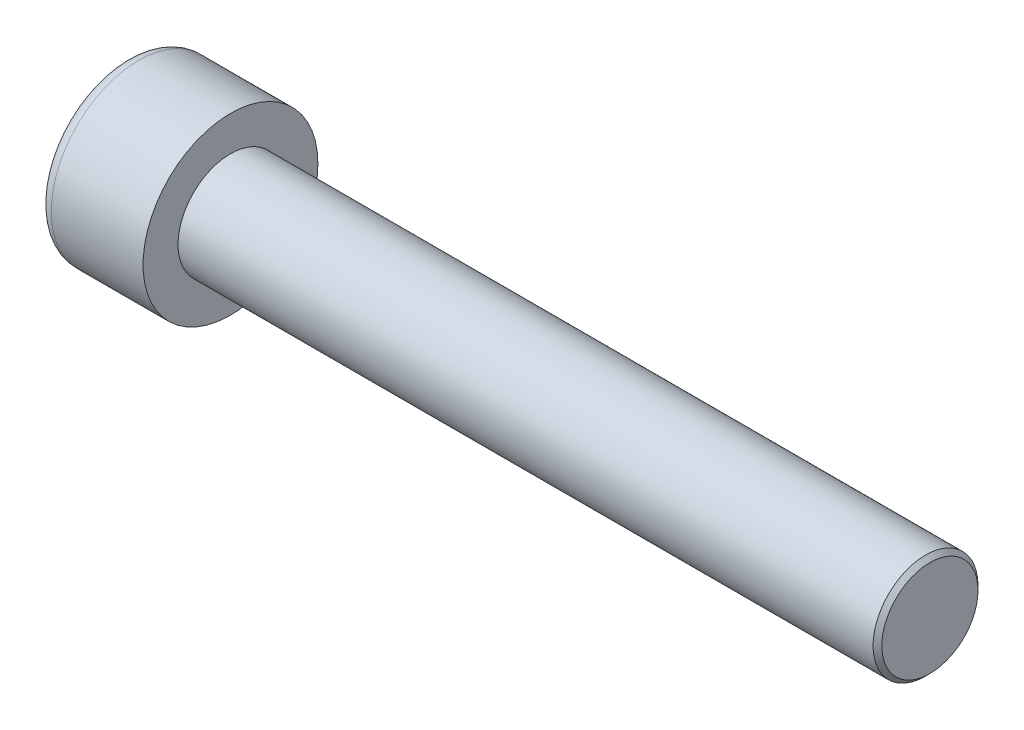
ISO-10303-21;
HEADER;
FILE_DESCRIPTION(('STEP AP214'),'2;1');
FILE_NAME('part.step','',(''),(''),'','','');
FILE_SCHEMA(('AUTOMOTIVE_DESIGN { 1 0 10303 214 1 1 1 1 }'));
ENDSEC;
DATA;
#1=APPLICATION_CONTEXT('core data for automotive mechanical design processes');
#2=APPLICATION_PROTOCOL_DEFINITION('international standard','automotive_design',2000,#1);
#3=PRODUCT_CONTEXT('',#1,'mechanical');
#4=PRODUCT('Part','Part','',(#3));
#5=PRODUCT_RELATED_PRODUCT_CATEGORY('part','',(#4));
#6=PRODUCT_DEFINITION_FORMATION('','',#4);
#7=PRODUCT_DEFINITION_CONTEXT('part definition',#1,'design');
#8=PRODUCT_DEFINITION('design','',#6,#7);
#9=PRODUCT_DEFINITION_SHAPE('','',#8);
#10=(LENGTH_UNIT() NAMED_UNIT(*) SI_UNIT(.MILLI.,.METRE.));
#11=(NAMED_UNIT(*) PLANE_ANGLE_UNIT() SI_UNIT($,.RADIAN.));
#12=(NAMED_UNIT(*) SI_UNIT($,.STERADIAN.) SOLID_ANGLE_UNIT());
#13=UNCERTAINTY_MEASURE_WITH_UNIT(LENGTH_MEASURE(1.E-05),#10,'distance_accuracy_value','');
#14=(GEOMETRIC_REPRESENTATION_CONTEXT(3) GLOBAL_UNCERTAINTY_ASSIGNED_CONTEXT((#13)) GLOBAL_UNIT_ASSIGNED_CONTEXT((#10,
#11,#12)) REPRESENTATION_CONTEXT('',''));
#15=CARTESIAN_POINT('',(0.,0.,0.));
#16=DIRECTION('',(0.,0.,1.));
#17=DIRECTION('',(1.,0.,0.));
#18=AXIS2_PLACEMENT_3D('',#15,#16,#17);
#19=CARTESIAN_POINT('',(3.,-5.00000000000023,0.));
#20=DIRECTION('',(-1.00000000000001,0.,0.));
#21=DIRECTION('',(0.,0.,0.999999999999996));
#22=AXIS2_PLACEMENT_3D('',#19,#20,#21);
#23=PLANE('',#22);
#24=DIRECTION('',(0.,-0.866025403784444,-0.499999999999999));
#25=VECTOR('',#24,1.);
#26=CARTESIAN_POINT('',(3.,-1.11022302462516E-13,2.88675134594785));
#27=LINE('',#26,#25);
#28=CARTESIAN_POINT('',(3.,-1.25000000000011,2.16506350946111));
#29=VERTEX_POINT('',#28);
#30=CARTESIAN_POINT('',(3.,-2.50000000000012,1.44337567297398));
#31=VERTEX_POINT('',#30);
#32=EDGE_CURVE('E161',#29,#31,#27,.T.);
#33=ORIENTED_EDGE('',*,*,#32,.F.);
#34=CARTESIAN_POINT('',(3.,0.,0.));
#35=DIRECTION('',(-1.00000000000001,0.,0.));
#36=DIRECTION('',(0.,0.,0.999999999999996));
#37=AXIS2_PLACEMENT_3D('',#34,#35,#36);
#38=CIRCLE('',#37,2.5);
#39=CARTESIAN_POINT('',(3.,-2.50000000000031,-1.59594559789866E-13));
#40=VERTEX_POINT('',#39);
#41=EDGE_CURVE('E56',#29,#40,#38,.F.);
#42=ORIENTED_EDGE('',*,*,#41,.T.);
#43=DIRECTION('',(0.,0.,-0.999999999999996));
#44=VECTOR('',#43,1.);
#45=CARTESIAN_POINT('',(3.,-2.50000000000012,1.44337567297398));
#46=LINE('',#45,#44);
#47=EDGE_CURVE('E166',#31,#40,#46,.T.);
#48=ORIENTED_EDGE('',*,*,#47,.F.);
#49=EDGE_LOOP('',(#33,#42,#48));
#50=FACE_BOUND('',#49,.T.);
#51=ADVANCED_FACE('F41',(#50),#23,.T.);
#52=CARTESIAN_POINT('',(3.,-2.50000000000001,-1.44337567297437));
#53=VERTEX_POINT('',#52);
#54=EDGE_CURVE('E165',#40,#53,#46,.T.);
#55=ORIENTED_EDGE('',*,*,#54,.F.);
#56=CARTESIAN_POINT('',(3.,-1.25000000000003,-2.16506350946105));
#57=VERTEX_POINT('',#56);
#58=EDGE_CURVE('E141',#40,#57,#38,.F.);
#59=ORIENTED_EDGE('',*,*,#58,.T.);
#60=DIRECTION('',(0.,0.866025403784444,-0.499999999999997));
#61=VECTOR('',#60,1.);
#62=CARTESIAN_POINT('',(3.,-2.50000000000001,-1.44337567297437));
#63=LINE('',#62,#61);
#64=EDGE_CURVE('E149',#53,#57,#63,.T.);
#65=ORIENTED_EDGE('',*,*,#64,.F.);
#66=EDGE_LOOP('',(#55,#59,#65));
#67=FACE_BOUND('',#66,.T.);
#68=ADVANCED_FACE('F222',(#67),#23,.T.);
#69=CARTESIAN_POINT('',(3.,0.,-2.88675134594835));
#70=VERTEX_POINT('',#69);
#71=EDGE_CURVE('E139',#57,#70,#63,.T.);
#72=ORIENTED_EDGE('',*,*,#71,.F.);
#73=CARTESIAN_POINT('',(3.,1.24999999999989,-2.16506350946133));
#74=VERTEX_POINT('',#73);
#75=EDGE_CURVE('E123',#57,#74,#38,.F.);
#76=ORIENTED_EDGE('',*,*,#75,.T.);
#77=DIRECTION('',(0.,0.866025403784444,0.499999999999999));
#78=VECTOR('',#77,1.);
#79=CARTESIAN_POINT('',(3.,0.,-2.88675134594835));
#80=LINE('',#79,#78);
#81=EDGE_CURVE('E137',#70,#74,#80,.T.);
#82=ORIENTED_EDGE('',*,*,#81,.F.);
#83=EDGE_LOOP('',(#72,#76,#82));
#84=FACE_BOUND('',#83,.T.);
#85=ADVANCED_FACE('F135',(#84),#23,.T.);
#86=CARTESIAN_POINT('',(3.,2.50000000000003,-1.44337567297426));
#87=VERTEX_POINT('',#86);
#88=EDGE_CURVE('E143',#74,#87,#80,.T.);
#89=ORIENTED_EDGE('',*,*,#88,.F.);
#90=CARTESIAN_POINT('',(3.,0.,0.));
#91=DIRECTION('',(1.00000000000001,0.,0.));
#92=DIRECTION('',(0.,0.,-0.999999999999996));
#93=AXIS2_PLACEMENT_3D('',#90,#91,#92);
#94=CIRCLE('',#93,2.5);
#95=CARTESIAN_POINT('',(3.,2.5,0.));
#96=VERTEX_POINT('',#95);
#97=EDGE_CURVE('E121',#74,#96,#94,.T.);
#98=ORIENTED_EDGE('',*,*,#97,.T.);
#99=DIRECTION('',(0.,0.,0.999999999999996));
#100=VECTOR('',#99,1.);
#101=CARTESIAN_POINT('',(3.,2.50000000000003,-1.44337567297426));
#102=LINE('',#101,#100);
#103=EDGE_CURVE('E146',#87,#96,#102,.T.);
#104=ORIENTED_EDGE('',*,*,#103,.F.);
#105=EDGE_LOOP('',(#89,#98,#104));
#106=FACE_BOUND('',#105,.T.);
#107=ADVANCED_FACE('F144',(#106),#23,.T.);
#108=CARTESIAN_POINT('',(3.,2.49999999999983,1.44337567297409));
#109=VERTEX_POINT('',#108);
#110=EDGE_CURVE('E153',#96,#109,#102,.T.);
#111=ORIENTED_EDGE('',*,*,#110,.F.);
#112=CARTESIAN_POINT('',(3.,1.24999999999986,2.16506350946095));
#113=VERTEX_POINT('',#112);
#114=EDGE_CURVE('E126',#96,#113,#38,.F.);
#115=ORIENTED_EDGE('',*,*,#114,.T.);
#116=DIRECTION('',(0.,-0.866025403784444,0.499999999999997));
#117=VECTOR('',#116,1.);
#118=CARTESIAN_POINT('',(3.,2.49999999999983,1.44337567297409));
#119=LINE('',#118,#117);
#120=EDGE_CURVE('E158',#109,#113,#119,.T.);
#121=ORIENTED_EDGE('',*,*,#120,.F.);
#122=EDGE_LOOP('',(#111,#115,#121));
#123=FACE_BOUND('',#122,.T.);
#124=ADVANCED_FACE('F234',(#123),#23,.T.);
#125=CARTESIAN_POINT('',(3.,-1.11022302462516E-13,2.88675134594785));
#126=VERTEX_POINT('',#125);
#127=EDGE_CURVE('E157',#113,#126,#119,.T.);
#128=ORIENTED_EDGE('',*,*,#127,.F.);
#129=EDGE_CURVE('E202',#113,#29,#38,.F.);
#130=ORIENTED_EDGE('',*,*,#129,.T.);
#131=EDGE_CURVE('E162',#126,#29,#27,.T.);
#132=ORIENTED_EDGE('',*,*,#131,.F.);
#133=EDGE_LOOP('',(#128,#130,#132));
#134=FACE_BOUND('',#133,.T.);
#135=ADVANCED_FACE('F225',(#134),#23,.T.);
#136=CARTESIAN_POINT('',(0.,0.,0.));
#137=DIRECTION('',(1.00000000000001,0.,0.));
#138=DIRECTION('',(0.,0.,-0.999999999999996));
#139=AXIS2_PLACEMENT_3D('',#136,#137,#138);
#140=PLANE('',#139);
#141=CARTESIAN_POINT('',(0.,0.,0.));
#142=DIRECTION('',(1.00000000000001,0.,0.));
#143=DIRECTION('',(0.,0.,-0.999999999999996));
#144=AXIS2_PLACEMENT_3D('',#141,#142,#143);
#145=CIRCLE('',#144,4.25);
#146=CARTESIAN_POINT('',(0.,0.,-4.24999999999998));
#147=VERTEX_POINT('',#146);
#148=EDGE_CURVE('E207',#147,#147,#145,.F.);
#149=ORIENTED_EDGE('',*,*,#148,.T.);
#150=EDGE_LOOP('',(#149));
#151=FACE_BOUND('',#150,.T.);
#152=DIRECTION('',(0.,0.866025403784444,-0.499999999999997));
#153=VECTOR('',#152,1.);
#154=CARTESIAN_POINT('',(0.,-2.50000000000011,-1.4433756729742));
#155=LINE('',#154,#153);
#156=CARTESIAN_POINT('',(0.,-2.50000000000011,-1.4433756729742));
#157=VERTEX_POINT('',#156);
#158=CARTESIAN_POINT('',(0.,0.,-2.88675134594834));
#159=VERTEX_POINT('',#158);
#160=EDGE_CURVE('E64',#157,#159,#155,.T.);
#161=ORIENTED_EDGE('',*,*,#160,.T.);
#162=DIRECTION('',(0.,0.866025403784444,0.499999999999999));
#163=VECTOR('',#162,1.);
#164=CARTESIAN_POINT('',(0.,0.,-2.88675134594834));
#165=LINE('',#164,#163);
#166=CARTESIAN_POINT('',(0.,2.5,-1.44337567297426));
#167=VERTEX_POINT('',#166);
#168=EDGE_CURVE('E171',#159,#167,#165,.T.);
#169=ORIENTED_EDGE('',*,*,#168,.T.);
#170=DIRECTION('',(0.,0.,0.999999999999996));
#171=VECTOR('',#170,1.);
#172=CARTESIAN_POINT('',(0.,2.5,-1.44337567297426));
#173=LINE('',#172,#171);
#174=CARTESIAN_POINT('',(0.,2.49999999999978,1.44337567297404));
#175=VERTEX_POINT('',#174);
#176=EDGE_CURVE('E174',#167,#175,#173,.T.);
#177=ORIENTED_EDGE('',*,*,#176,.T.);
#178=DIRECTION('',(0.,-0.866025403784444,0.499999999999997));
#179=VECTOR('',#178,1.);
#180=CARTESIAN_POINT('',(0.,2.49999999999978,1.44337567297404));
#181=LINE('',#180,#179);
#182=CARTESIAN_POINT('',(0.,-1.73472347597681E-13,2.88675134594808));
#183=VERTEX_POINT('',#182);
#184=EDGE_CURVE('E177',#175,#183,#181,.T.);
#185=ORIENTED_EDGE('',*,*,#184,.T.);
#186=DIRECTION('',(0.,-0.866025403784444,-0.499999999999999));
#187=VECTOR('',#186,1.);
#188=CARTESIAN_POINT('',(0.,-1.73472347597681E-13,2.88675134594808));
#189=LINE('',#188,#187);
#190=CARTESIAN_POINT('',(0.,-2.50000000000025,1.44337567297404));
#191=VERTEX_POINT('',#190);
#192=EDGE_CURVE('E180',#183,#191,#189,.T.);
#193=ORIENTED_EDGE('',*,*,#192,.T.);
#194=DIRECTION('',(0.,0.,-0.999999999999996));
#195=VECTOR('',#194,1.);
#196=CARTESIAN_POINT('',(0.,-2.50000000000025,1.44337567297404));
#197=LINE('',#196,#195);
#198=EDGE_CURVE('E183',#191,#157,#197,.T.);
#199=ORIENTED_EDGE('',*,*,#198,.T.);
#200=EDGE_LOOP('',(#161,#169,#177,#185,#193,#199));
#201=FACE_BOUND('',#200,.T.);
#202=ADVANCED_FACE('F233',(#151,#201),#140,.F.);
#203=CARTESIAN_POINT('',(6.,0.,0.));
#204=DIRECTION('',(1.00000000000001,0.,0.));
#205=DIRECTION('',(0.,0.,-0.999999999999996));
#206=AXIS2_PLACEMENT_3D('',#203,#204,#205);
#207=PLANE('',#206);
#208=CARTESIAN_POINT('',(6.,0.,0.));
#209=DIRECTION('',(1.00000000000001,0.,0.));
#210=DIRECTION('',(0.,0.,-0.999999999999996));
#211=AXIS2_PLACEMENT_3D('',#208,#209,#210);
#212=CIRCLE('',#211,5.);
#213=CARTESIAN_POINT('',(6.,0.,-4.99999999999992));
#214=VERTEX_POINT('',#213);
#215=EDGE_CURVE('E199',#214,#214,#212,.T.);
#216=ORIENTED_EDGE('',*,*,#215,.T.);
#217=EDGE_LOOP('',(#216));
#218=FACE_BOUND('',#217,.T.);
#219=CARTESIAN_POINT('',(6.,0.,0.));
#220=DIRECTION('',(1.00000000000001,0.,0.));
#221=DIRECTION('',(0.,0.,-0.999999999999996));
#222=AXIS2_PLACEMENT_3D('',#219,#220,#221);
#223=CIRCLE('',#222,3.);
#224=CARTESIAN_POINT('',(6.,0.,-2.99999999999993));
#225=VERTEX_POINT('',#224);
#226=EDGE_CURVE('E196',#225,#225,#223,.T.);
#227=ORIENTED_EDGE('',*,*,#226,.F.);
#228=EDGE_LOOP('',(#227));
#229=FACE_BOUND('',#228,.T.);
#230=ADVANCED_FACE('F240',(#218,#229),#207,.T.);
#231=CARTESIAN_POINT('',(6.,0.,0.));
#232=DIRECTION('',(-1.00000000000001,0.,0.));
#233=DIRECTION('',(0.,0.,0.999999999999996));
#234=AXIS2_PLACEMENT_3D('',#231,#232,#233);
#235=CYLINDRICAL_SURFACE('',#234,5.);
#236=CARTESIAN_POINT('',(0.750000000000001,0.,0.));
#237=DIRECTION('',(1.00000000000001,0.,0.));
#238=DIRECTION('',(0.,0.,-0.999999999999996));
#239=AXIS2_PLACEMENT_3D('',#236,#237,#238);
#240=CIRCLE('',#239,5.);
#241=CARTESIAN_POINT('',(0.750000000000001,0.,-4.99999999999998));
#242=VERTEX_POINT('',#241);
#243=EDGE_CURVE('E204',#242,#242,#240,.T.);
#244=ORIENTED_EDGE('',*,*,#243,.T.);
#245=EDGE_LOOP('',(#244));
#246=FACE_BOUND('',#245,.T.);
#247=ORIENTED_EDGE('',*,*,#215,.F.);
#248=EDGE_LOOP('',(#247));
#249=FACE_BOUND('',#248,.T.);
#250=ADVANCED_FACE('F285',(#246,#249),#235,.T.);
#251=CARTESIAN_POINT('',(46.0000000000002,-2.77555756156289E-13,-2.77555756156289E-13));
#252=DIRECTION('',(-1.00000000000001,0.,0.));
#253=DIRECTION('',(0.,0.,0.999999999999996));
#254=AXIS2_PLACEMENT_3D('',#251,#252,#253);
#255=CYLINDRICAL_SURFACE('',#254,3.);
#256=CARTESIAN_POINT('',(45.7500000000002,-3.64291929955129E-13,-2.22044604925031E-13));
#257=DIRECTION('',(1.00000000000001,0.,0.));
#258=DIRECTION('',(0.,0.,-0.999999999999996));
#259=AXIS2_PLACEMENT_3D('',#256,#257,#258);
#260=CIRCLE('',#259,3.);
#261=CARTESIAN_POINT('',(45.7500000000002,-3.64291929955129E-13,-3.00000000000021));
#262=VERTEX_POINT('',#261);
#263=EDGE_CURVE('E11',#262,#262,#260,.F.);
#264=ORIENTED_EDGE('',*,*,#263,.T.);
#265=EDGE_LOOP('',(#264));
#266=FACE_BOUND('',#265,.T.);
#267=ORIENTED_EDGE('',*,*,#226,.T.);
#268=EDGE_LOOP('',(#267));
#269=FACE_BOUND('',#268,.T.);
#270=ADVANCED_FACE('F282',(#266,#269),#255,.T.);
#271=CARTESIAN_POINT('',(46.0000000000002,-2.77555756156289E-13,-2.77555756156289E-13));
#272=DIRECTION('',(1.00000000000001,0.,0.));
#273=DIRECTION('',(0.,0.,-0.999999999999996));
#274=AXIS2_PLACEMENT_3D('',#271,#272,#273);
#275=PLANE('',#274);
#276=CARTESIAN_POINT('',(46.0000000000002,-2.77555756156289E-13,-2.77555756156289E-13));
#277=DIRECTION('',(1.00000000000001,0.,0.));
#278=DIRECTION('',(0.,0.,-0.999999999999996));
#279=AXIS2_PLACEMENT_3D('',#276,#277,#278);
#280=CIRCLE('',#279,2.75);
#281=CARTESIAN_POINT('',(46.0000000000002,-2.77555756156289E-13,-2.75000000000027));
#282=VERTEX_POINT('',#281);
#283=EDGE_CURVE('E49',#282,#282,#280,.T.);
#284=ORIENTED_EDGE('',*,*,#283,.T.);
#285=EDGE_LOOP('',(#284));
#286=FACE_BOUND('',#285,.T.);
#287=ADVANCED_FACE('F212',(#286),#275,.T.);
#288=CARTESIAN_POINT('',(3.,-2.50000000000001,-1.44337567297437));
#289=DIRECTION('',(0.,0.500000000000004,0.866025403784436));
#290=DIRECTION('',(0.,-0.866025403784444,0.499999999999997));
#291=AXIS2_PLACEMENT_3D('',#288,#289,#290);
#292=PLANE('',#291);
#293=ORIENTED_EDGE('',*,*,#160,.F.);
#294=DIRECTION('',(-1.00000000000001,0.,0.));
#295=VECTOR('',#294,1.);
#296=CARTESIAN_POINT('',(3.,-2.50000000000001,-1.44337567297437));
#297=LINE('',#296,#295);
#298=EDGE_CURVE('E169',#53,#157,#297,.T.);
#299=ORIENTED_EDGE('',*,*,#298,.F.);
#300=ORIENTED_EDGE('',*,*,#64,.T.);
#301=ORIENTED_EDGE('',*,*,#71,.T.);
#302=DIRECTION('',(-1.00000000000001,0.,0.));
#303=VECTOR('',#302,1.);
#304=CARTESIAN_POINT('',(3.,0.,-2.88675134594835));
#305=LINE('',#304,#303);
#306=EDGE_CURVE('E152',#70,#159,#305,.T.);
#307=ORIENTED_EDGE('',*,*,#306,.T.);
#308=EDGE_LOOP('',(#293,#299,#300,#301,#307));
#309=FACE_BOUND('',#308,.T.);
#310=ADVANCED_FACE('F256',(#309),#292,.T.);
#311=CARTESIAN_POINT('',(3.,0.,-2.88675134594835));
#312=DIRECTION('',(0.,-0.500000000000003,0.866025403784434));
#313=DIRECTION('',(0.,-0.866025403784444,-0.499999999999999));
#314=AXIS2_PLACEMENT_3D('',#311,#312,#313);
#315=PLANE('',#314);
#316=ORIENTED_EDGE('',*,*,#168,.F.);
#317=ORIENTED_EDGE('',*,*,#306,.F.);
#318=ORIENTED_EDGE('',*,*,#81,.T.);
#319=ORIENTED_EDGE('',*,*,#88,.T.);
#320=DIRECTION('',(-1.00000000000001,0.,0.));
#321=VECTOR('',#320,1.);
#322=CARTESIAN_POINT('',(3.,2.50000000000003,-1.44337567297426));
#323=LINE('',#322,#321);
#324=EDGE_CURVE('E193',#87,#167,#323,.T.);
#325=ORIENTED_EDGE('',*,*,#324,.T.);
#326=EDGE_LOOP('',(#316,#317,#318,#319,#325));
#327=FACE_BOUND('',#326,.T.);
#328=ADVANCED_FACE('F151',(#327),#315,.T.);
#329=CARTESIAN_POINT('',(3.,2.50000000000003,-1.44337567297426));
#330=DIRECTION('',(0.,-1.00000000000001,0.));
#331=DIRECTION('',(0.,0.,-0.999999999999996));
#332=AXIS2_PLACEMENT_3D('',#329,#330,#331);
#333=PLANE('',#332);
#334=ORIENTED_EDGE('',*,*,#176,.F.);
#335=ORIENTED_EDGE('',*,*,#324,.F.);
#336=ORIENTED_EDGE('',*,*,#103,.T.);
#337=ORIENTED_EDGE('',*,*,#110,.T.);
#338=DIRECTION('',(-1.00000000000001,0.,0.));
#339=VECTOR('',#338,1.);
#340=CARTESIAN_POINT('',(3.,2.49999999999983,1.44337567297409));
#341=LINE('',#340,#339);
#342=EDGE_CURVE('E191',#109,#175,#341,.T.);
#343=ORIENTED_EDGE('',*,*,#342,.T.);
#344=EDGE_LOOP('',(#334,#335,#336,#337,#343));
#345=FACE_BOUND('',#344,.T.);
#346=ADVANCED_FACE('F254',(#345),#333,.T.);
#347=CARTESIAN_POINT('',(3.,2.49999999999983,1.44337567297409));
#348=DIRECTION('',(0.,-0.500000000000002,-0.866025403784436));
#349=DIRECTION('',(0.,0.866025403784444,-0.499999999999997));
#350=AXIS2_PLACEMENT_3D('',#347,#348,#349);
#351=PLANE('',#350);
#352=ORIENTED_EDGE('',*,*,#184,.F.);
#353=ORIENTED_EDGE('',*,*,#342,.F.);
#354=ORIENTED_EDGE('',*,*,#120,.T.);
#355=ORIENTED_EDGE('',*,*,#127,.T.);
#356=DIRECTION('',(-1.00000000000001,0.,0.));
#357=VECTOR('',#356,1.);
#358=CARTESIAN_POINT('',(3.,-1.11022302462516E-13,2.88675134594785));
#359=LINE('',#358,#357);
#360=EDGE_CURVE('E189',#126,#183,#359,.T.);
#361=ORIENTED_EDGE('',*,*,#360,.T.);
#362=EDGE_LOOP('',(#352,#353,#354,#355,#361));
#363=FACE_BOUND('',#362,.T.);
#364=ADVANCED_FACE('F251',(#363),#351,.T.);
#365=CARTESIAN_POINT('',(3.,-1.11022302462516E-13,2.88675134594785));
#366=DIRECTION('',(0.,0.500000000000003,-0.866025403784434));
#367=DIRECTION('',(0.,0.866025403784444,0.499999999999999));
#368=AXIS2_PLACEMENT_3D('',#365,#366,#367);
#369=PLANE('',#368);
#370=ORIENTED_EDGE('',*,*,#192,.F.);
#371=ORIENTED_EDGE('',*,*,#360,.F.);
#372=ORIENTED_EDGE('',*,*,#131,.T.);
#373=ORIENTED_EDGE('',*,*,#32,.T.);
#374=DIRECTION('',(-1.00000000000001,0.,0.));
#375=VECTOR('',#374,1.);
#376=CARTESIAN_POINT('',(3.,-2.50000000000012,1.44337567297398));
#377=LINE('',#376,#375);
#378=EDGE_CURVE('E187',#31,#191,#377,.T.);
#379=ORIENTED_EDGE('',*,*,#378,.T.);
#380=EDGE_LOOP('',(#370,#371,#372,#373,#379));
#381=FACE_BOUND('',#380,.T.);
#382=ADVANCED_FACE('F265',(#381),#369,.T.);
#383=CARTESIAN_POINT('',(3.,-2.50000000000012,1.44337567297398));
#384=DIRECTION('',(0.,1.00000000000001,0.));
#385=DIRECTION('',(0.,0.,0.999999999999996));
#386=AXIS2_PLACEMENT_3D('',#383,#384,#385);
#387=PLANE('',#386);
#388=ORIENTED_EDGE('',*,*,#198,.F.);
#389=ORIENTED_EDGE('',*,*,#378,.F.);
#390=ORIENTED_EDGE('',*,*,#47,.T.);
#391=ORIENTED_EDGE('',*,*,#54,.T.);
#392=ORIENTED_EDGE('',*,*,#298,.T.);
#393=EDGE_LOOP('',(#388,#389,#390,#391,#392));
#394=FACE_BOUND('',#393,.T.);
#395=ADVANCED_FACE('F118',(#394),#387,.T.);
#396=CARTESIAN_POINT('',(3.,0.,0.));
#397=DIRECTION('',(-1.00000000000001,0.,0.));
#398=DIRECTION('',(0.,0.,0.999999999999996));
#399=AXIS2_PLACEMENT_3D('',#396,#397,#398);
#400=CONICAL_SURFACE('',#399,2.5,1.04719755119659);
#401=CARTESIAN_POINT('',(4.44337567297408,0.,0.));
#402=VERTEX_POINT('',#401);
#403=VERTEX_LOOP('',#402);
#404=FACE_BOUND('',#403,.T.);
#405=ORIENTED_EDGE('',*,*,#97,.F.);
#406=ORIENTED_EDGE('',*,*,#75,.F.);
#407=ORIENTED_EDGE('',*,*,#58,.F.);
#408=ORIENTED_EDGE('',*,*,#41,.F.);
#409=ORIENTED_EDGE('',*,*,#129,.F.);
#410=ORIENTED_EDGE('',*,*,#114,.F.);
#411=EDGE_LOOP('',(#405,#406,#407,#408,#409,#410));
#412=FACE_BOUND('',#411,.T.);
#413=ADVANCED_FACE('F115',(#404,#412),#400,.F.);
#414=CARTESIAN_POINT('',(0.750000000000001,0.,0.));
#415=DIRECTION('',(1.00000000000001,0.,0.));
#416=DIRECTION('',(0.,0.,-0.999999999999996));
#417=AXIS2_PLACEMENT_3D('',#414,#415,#416);
#418=TOROIDAL_SURFACE('',#417,4.25,0.75);
#419=ORIENTED_EDGE('',*,*,#148,.F.);
#420=EDGE_LOOP('',(#419));
#421=FACE_BOUND('',#420,.T.);
#422=ORIENTED_EDGE('',*,*,#243,.F.);
#423=EDGE_LOOP('',(#422));
#424=FACE_BOUND('',#423,.T.);
#425=ADVANCED_FACE('F117',(#421,#424),#418,.T.);
#426=CARTESIAN_POINT('',(46.0000000000002,-2.77555756156289E-13,-2.77555756156289E-13));
#427=DIRECTION('',(-1.00000000000001,0.,0.));
#428=DIRECTION('',(0.,0.,0.999999999999996));
#429=AXIS2_PLACEMENT_3D('',#426,#427,#428);
#430=CONICAL_SURFACE('',#429,2.75,0.785398163397458);
#431=ORIENTED_EDGE('',*,*,#263,.F.);
#432=EDGE_LOOP('',(#431));
#433=FACE_BOUND('',#432,.T.);
#434=ORIENTED_EDGE('',*,*,#283,.F.);
#435=EDGE_LOOP('',(#434));
#436=FACE_BOUND('',#435,.T.);
#437=ADVANCED_FACE('F43',(#433,#436),#430,.T.);
#438=CLOSED_SHELL('',(#51,#68,#85,#107,#124,#135,#202,#230,#250,#270,#287,#310,#328,#346,#364,
#382,#395,#413,#425,#437));
#439=MANIFOLD_SOLID_BREP('B2',#438);
#440=ADVANCED_BREP_SHAPE_REPRESENTATION('',(#18,#439),#14);
#441=SHAPE_DEFINITION_REPRESENTATION(#9,#440);
ENDSEC;
END-ISO-10303-21;
